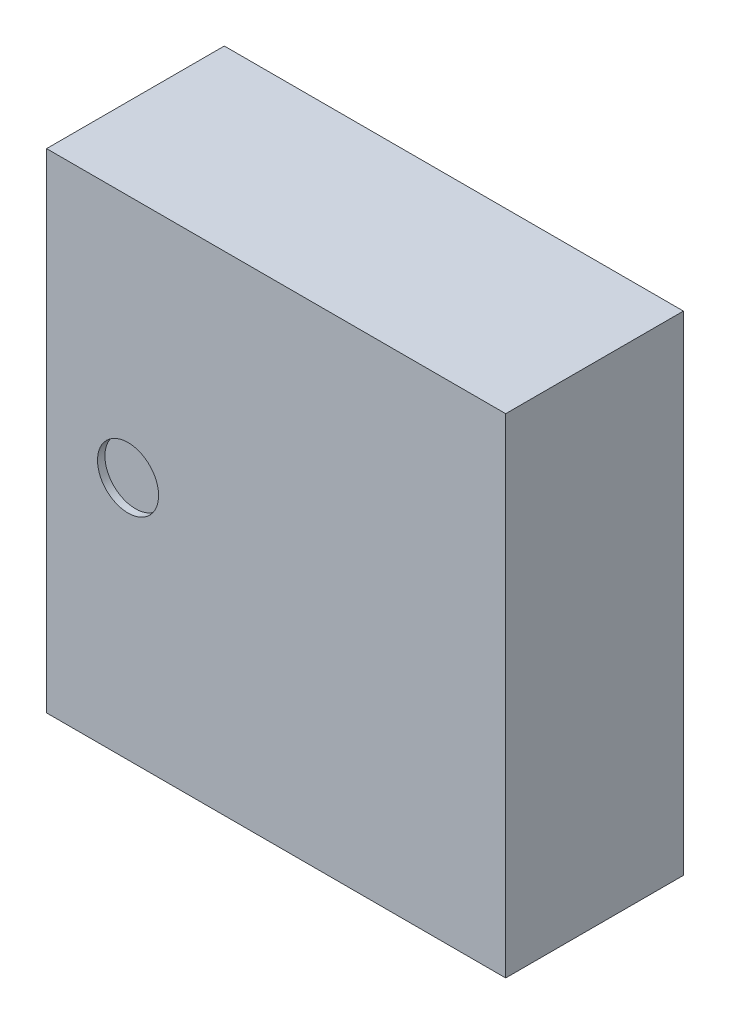
ISO-10303-21;
HEADER;
FILE_DESCRIPTION(('STEP AP214'),'2;1');
FILE_NAME('part.step','',(''),(''),'','','');
FILE_SCHEMA(('AUTOMOTIVE_DESIGN { 1 0 10303 214 1 1 1 1 }'));
ENDSEC;
DATA;
#1=APPLICATION_CONTEXT('core data for automotive mechanical design processes');
#2=APPLICATION_PROTOCOL_DEFINITION('international standard','automotive_design',2000,#1);
#3=PRODUCT_CONTEXT('',#1,'mechanical');
#4=PRODUCT('Part','Part','',(#3));
#5=PRODUCT_RELATED_PRODUCT_CATEGORY('part','',(#4));
#6=PRODUCT_DEFINITION_FORMATION('','',#4);
#7=PRODUCT_DEFINITION_CONTEXT('part definition',#1,'design');
#8=PRODUCT_DEFINITION('design','',#6,#7);
#9=PRODUCT_DEFINITION_SHAPE('','',#8);
#10=(LENGTH_UNIT() NAMED_UNIT(*) SI_UNIT(.MILLI.,.METRE.));
#11=(NAMED_UNIT(*) PLANE_ANGLE_UNIT() SI_UNIT($,.RADIAN.));
#12=(NAMED_UNIT(*) SI_UNIT($,.STERADIAN.) SOLID_ANGLE_UNIT());
#13=UNCERTAINTY_MEASURE_WITH_UNIT(LENGTH_MEASURE(1.E-05),#10,'distance_accuracy_value','');
#14=(GEOMETRIC_REPRESENTATION_CONTEXT(3) GLOBAL_UNCERTAINTY_ASSIGNED_CONTEXT((#13)) GLOBAL_UNIT_ASSIGNED_CONTEXT((#10,
#11,#12)) REPRESENTATION_CONTEXT('',''));
#15=CARTESIAN_POINT('',(0.,0.,0.));
#16=DIRECTION('',(0.,0.,1.));
#17=DIRECTION('',(1.,0.,0.));
#18=AXIS2_PLACEMENT_3D('',#15,#16,#17);
#19=CARTESIAN_POINT('',(1.1,3.3,2.33));
#20=DIRECTION('',(0.,0.,1.));
#21=DIRECTION('',(1.,0.,0.));
#22=AXIS2_PLACEMENT_3D('',#19,#20,#21);
#23=PLANE('',#22);
#24=CARTESIAN_POINT('',(1.1,3.3,2.33));
#25=DIRECTION('',(0.,0.,1.));
#26=DIRECTION('',(1.,0.,0.));
#27=AXIS2_PLACEMENT_3D('',#24,#25,#26);
#28=CIRCLE('',#27,0.4125);
#29=CARTESIAN_POINT('',(1.5125,3.3,2.33));
#30=VERTEX_POINT('',#29);
#31=EDGE_CURVE('E19',#30,#30,#28,.T.);
#32=ORIENTED_EDGE('',*,*,#31,.T.);
#33=EDGE_LOOP('',(#32));
#34=FACE_BOUND('',#33,.T.);
#35=ADVANCED_FACE('F16',(#34),#23,.T.);
#36=CARTESIAN_POINT('',(1.1,3.3,2.33));
#37=DIRECTION('',(0.,0.,1.));
#38=DIRECTION('',(1.,0.,0.));
#39=AXIS2_PLACEMENT_3D('',#36,#37,#38);
#40=CYLINDRICAL_SURFACE('',#39,0.4125);
#41=CARTESIAN_POINT('',(1.1,3.3,2.43));
#42=DIRECTION('',(0.,0.,1.));
#43=DIRECTION('',(1.,0.,0.));
#44=AXIS2_PLACEMENT_3D('',#41,#42,#43);
#45=CIRCLE('',#44,0.4125);
#46=CARTESIAN_POINT('',(1.5125,3.3,2.43));
#47=VERTEX_POINT('',#46);
#48=EDGE_CURVE('E67',#47,#47,#45,.F.);
#49=ORIENTED_EDGE('',*,*,#48,.F.);
#50=EDGE_LOOP('',(#49));
#51=FACE_BOUND('',#50,.T.);
#52=ORIENTED_EDGE('',*,*,#31,.F.);
#53=EDGE_LOOP('',(#52));
#54=FACE_BOUND('',#53,.T.);
#55=ADVANCED_FACE('F96',(#51,#54),#40,.F.);
#56=CARTESIAN_POINT('',(0.,0.,2.43));
#57=DIRECTION('',(0.,0.,1.));
#58=DIRECTION('',(1.,0.,0.));
#59=AXIS2_PLACEMENT_3D('',#56,#57,#58);
#60=PLANE('',#59);
#61=ORIENTED_EDGE('',*,*,#48,.T.);
#62=EDGE_LOOP('',(#61));
#63=FACE_BOUND('',#62,.T.);
#64=DIRECTION('',(0.,1.,0.));
#65=VECTOR('',#64,1.);
#66=CARTESIAN_POINT('',(6.2,0.,2.43));
#67=LINE('',#66,#65);
#68=CARTESIAN_POINT('',(6.2,6.6,2.43));
#69=VERTEX_POINT('',#68);
#70=CARTESIAN_POINT('',(6.2,0.,2.43));
#71=VERTEX_POINT('',#70);
#72=EDGE_CURVE('E186',#69,#71,#67,.F.);
#73=ORIENTED_EDGE('',*,*,#72,.F.);
#74=DIRECTION('',(1.,0.,0.));
#75=VECTOR('',#74,1.);
#76=CARTESIAN_POINT('',(0.,6.6,2.43));
#77=LINE('',#76,#75);
#78=CARTESIAN_POINT('',(0.,6.6,2.43));
#79=VERTEX_POINT('',#78);
#80=EDGE_CURVE('E60',#79,#69,#77,.T.);
#81=ORIENTED_EDGE('',*,*,#80,.F.);
#82=DIRECTION('',(0.,1.,0.));
#83=VECTOR('',#82,1.);
#84=CARTESIAN_POINT('',(0.,0.,2.43));
#85=LINE('',#84,#83);
#86=CARTESIAN_POINT('',(0.,0.,2.43));
#87=VERTEX_POINT('',#86);
#88=EDGE_CURVE('E58',#79,#87,#85,.F.);
#89=ORIENTED_EDGE('',*,*,#88,.T.);
#90=DIRECTION('',(1.,0.,0.));
#91=VECTOR('',#90,1.);
#92=CARTESIAN_POINT('',(0.,0.,2.43));
#93=LINE('',#92,#91);
#94=EDGE_CURVE('E55',#87,#71,#93,.T.);
#95=ORIENTED_EDGE('',*,*,#94,.T.);
#96=EDGE_LOOP('',(#73,#81,#89,#95));
#97=FACE_BOUND('',#96,.T.);
#98=ADVANCED_FACE('F59',(#63,#97),#60,.T.);
#99=CARTESIAN_POINT('',(0.,0.,0.03));
#100=DIRECTION('',(1.,0.,0.));
#101=DIRECTION('',(0.,0.,-1.));
#102=AXIS2_PLACEMENT_3D('',#99,#100,#101);
#103=PLANE('',#102);
#104=DIRECTION('',(0.,0.,1.));
#105=VECTOR('',#104,1.);
#106=CARTESIAN_POINT('',(0.,6.6,0.03));
#107=LINE('',#106,#105);
#108=CARTESIAN_POINT('',(0.,6.6,0.03));
#109=VERTEX_POINT('',#108);
#110=EDGE_CURVE('E192',#109,#79,#107,.T.);
#111=ORIENTED_EDGE('',*,*,#110,.F.);
#112=DIRECTION('',(0.,1.,0.));
#113=VECTOR('',#112,1.);
#114=CARTESIAN_POINT('',(0.,0.,0.03));
#115=LINE('',#114,#113);
#116=CARTESIAN_POINT('',(0.,0.,0.03));
#117=VERTEX_POINT('',#116);
#118=EDGE_CURVE('E79',#109,#117,#115,.F.);
#119=ORIENTED_EDGE('',*,*,#118,.T.);
#120=DIRECTION('',(0.,0.,1.));
#121=VECTOR('',#120,1.);
#122=CARTESIAN_POINT('',(0.,0.,0.03));
#123=LINE('',#122,#121);
#124=EDGE_CURVE('E66',#117,#87,#123,.T.);
#125=ORIENTED_EDGE('',*,*,#124,.T.);
#126=ORIENTED_EDGE('',*,*,#88,.F.);
#127=EDGE_LOOP('',(#111,#119,#125,#126));
#128=FACE_BOUND('',#127,.T.);
#129=ADVANCED_FACE('F78',(#128),#103,.F.);
#130=CARTESIAN_POINT('',(0.,0.,0.03));
#131=DIRECTION('',(0.,1.,0.));
#132=DIRECTION('',(0.,0.,1.));
#133=AXIS2_PLACEMENT_3D('',#130,#131,#132);
#134=PLANE('',#133);
#135=ORIENTED_EDGE('',*,*,#94,.F.);
#136=ORIENTED_EDGE('',*,*,#124,.F.);
#137=DIRECTION('',(1.,0.,0.));
#138=VECTOR('',#137,1.);
#139=CARTESIAN_POINT('',(0.,0.,0.03));
#140=LINE('',#139,#138);
#141=CARTESIAN_POINT('',(6.2,0.,0.03));
#142=VERTEX_POINT('',#141);
#143=EDGE_CURVE('E189',#117,#142,#140,.T.);
#144=ORIENTED_EDGE('',*,*,#143,.T.);
#145=DIRECTION('',(0.,0.,-1.));
#146=VECTOR('',#145,1.);
#147=CARTESIAN_POINT('',(6.2,0.,0.03));
#148=LINE('',#147,#146);
#149=EDGE_CURVE('E74',#71,#142,#148,.T.);
#150=ORIENTED_EDGE('',*,*,#149,.F.);
#151=EDGE_LOOP('',(#135,#136,#144,#150));
#152=FACE_BOUND('',#151,.T.);
#153=ADVANCED_FACE('F71',(#152),#134,.F.);
#154=CARTESIAN_POINT('',(6.2,0.,0.03));
#155=DIRECTION('',(1.,0.,0.));
#156=DIRECTION('',(0.,0.,-1.));
#157=AXIS2_PLACEMENT_3D('',#154,#155,#156);
#158=PLANE('',#157);
#159=DIRECTION('',(0.,0.,1.));
#160=VECTOR('',#159,1.);
#161=CARTESIAN_POINT('',(6.2,6.6,0.03));
#162=LINE('',#161,#160);
#163=CARTESIAN_POINT('',(6.2,6.6,0.03));
#164=VERTEX_POINT('',#163);
#165=EDGE_CURVE('E34',#69,#164,#162,.F.);
#166=ORIENTED_EDGE('',*,*,#165,.F.);
#167=ORIENTED_EDGE('',*,*,#72,.T.);
#168=ORIENTED_EDGE('',*,*,#149,.T.);
#169=DIRECTION('',(0.,1.,0.));
#170=VECTOR('',#169,1.);
#171=CARTESIAN_POINT('',(6.2,0.,0.03));
#172=LINE('',#171,#170);
#173=EDGE_CURVE('E26',#142,#164,#172,.T.);
#174=ORIENTED_EDGE('',*,*,#173,.T.);
#175=EDGE_LOOP('',(#166,#167,#168,#174));
#176=FACE_BOUND('',#175,.T.);
#177=ADVANCED_FACE('F113',(#176),#158,.T.);
#178=CARTESIAN_POINT('',(0.,6.6,0.03));
#179=DIRECTION('',(0.,1.,0.));
#180=DIRECTION('',(0.,0.,1.));
#181=AXIS2_PLACEMENT_3D('',#178,#179,#180);
#182=PLANE('',#181);
#183=ORIENTED_EDGE('',*,*,#80,.T.);
#184=ORIENTED_EDGE('',*,*,#165,.T.);
#185=DIRECTION('',(1.,0.,0.));
#186=VECTOR('',#185,1.);
#187=CARTESIAN_POINT('',(0.,6.6,0.03));
#188=LINE('',#187,#186);
#189=EDGE_CURVE('E11',#164,#109,#188,.F.);
#190=ORIENTED_EDGE('',*,*,#189,.T.);
#191=ORIENTED_EDGE('',*,*,#110,.T.);
#192=EDGE_LOOP('',(#183,#184,#190,#191));
#193=FACE_BOUND('',#192,.T.);
#194=ADVANCED_FACE('F107',(#193),#182,.T.);
#195=CARTESIAN_POINT('',(0.,0.,0.03));
#196=DIRECTION('',(0.,0.,1.));
#197=DIRECTION('',(1.,0.,0.));
#198=AXIS2_PLACEMENT_3D('',#195,#196,#197);
#199=PLANE('',#198);
#200=ORIENTED_EDGE('',*,*,#173,.F.);
#201=ORIENTED_EDGE('',*,*,#143,.F.);
#202=ORIENTED_EDGE('',*,*,#118,.F.);
#203=ORIENTED_EDGE('',*,*,#189,.F.);
#204=EDGE_LOOP('',(#200,#201,#202,#203));
#205=FACE_BOUND('',#204,.T.);
#206=ADVANCED_FACE('F105',(#205),#199,.F.);
#207=CLOSED_SHELL('',(#35,#55,#98,#129,#153,#177,#194,#206));
#208=MANIFOLD_SOLID_BREP('B1',#207);
#209=ADVANCED_BREP_SHAPE_REPRESENTATION('',(#18,#208),#14);
#210=SHAPE_DEFINITION_REPRESENTATION(#9,#209);
ENDSEC;
END-ISO-10303-21;
